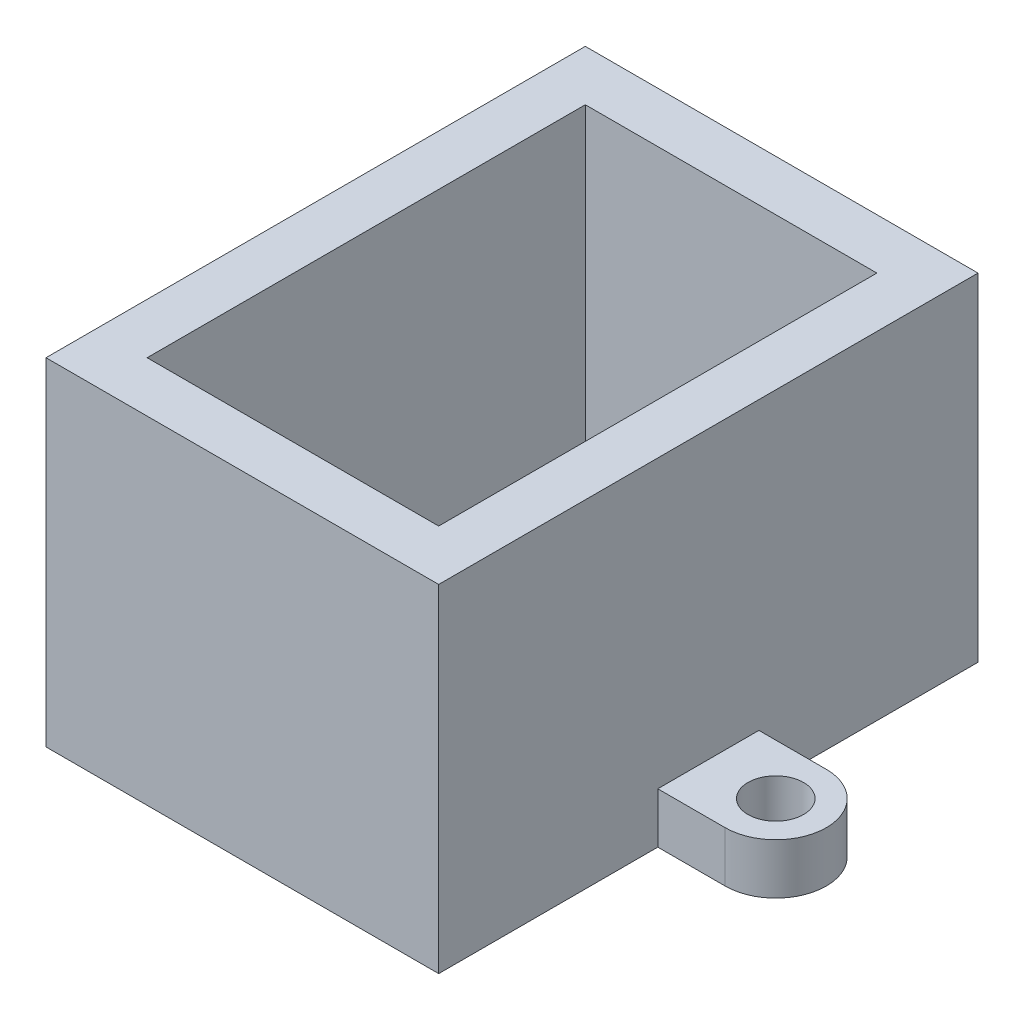
ISO-10303-21;
HEADER;
FILE_DESCRIPTION(('STEP AP214'),'2;1');
FILE_NAME('part.step','',(''),(''),'','','');
FILE_SCHEMA(('AUTOMOTIVE_DESIGN { 1 0 10303 214 1 1 1 1 }'));
ENDSEC;
DATA;
#1=APPLICATION_CONTEXT('core data for automotive mechanical design processes');
#2=APPLICATION_PROTOCOL_DEFINITION('international standard','automotive_design',2000,#1);
#3=PRODUCT_CONTEXT('',#1,'mechanical');
#4=PRODUCT('Part','Part','',(#3));
#5=PRODUCT_RELATED_PRODUCT_CATEGORY('part','',(#4));
#6=PRODUCT_DEFINITION_FORMATION('','',#4);
#7=PRODUCT_DEFINITION_CONTEXT('part definition',#1,'design');
#8=PRODUCT_DEFINITION('design','',#6,#7);
#9=PRODUCT_DEFINITION_SHAPE('','',#8);
#10=(LENGTH_UNIT() NAMED_UNIT(*) SI_UNIT(.MILLI.,.METRE.));
#11=(NAMED_UNIT(*) PLANE_ANGLE_UNIT() SI_UNIT($,.RADIAN.));
#12=(NAMED_UNIT(*) SI_UNIT($,.STERADIAN.) SOLID_ANGLE_UNIT());
#13=UNCERTAINTY_MEASURE_WITH_UNIT(LENGTH_MEASURE(1.E-05),#10,'distance_accuracy_value','');
#14=(GEOMETRIC_REPRESENTATION_CONTEXT(3) GLOBAL_UNCERTAINTY_ASSIGNED_CONTEXT((#13)) GLOBAL_UNIT_ASSIGNED_CONTEXT((#10,
#11,#12)) REPRESENTATION_CONTEXT('',''));
#15=CARTESIAN_POINT('',(0.,0.,0.));
#16=DIRECTION('',(0.,0.,1.));
#17=DIRECTION('',(1.,0.,0.));
#18=AXIS2_PLACEMENT_3D('',#15,#16,#17);
#19=CARTESIAN_POINT('',(11.65,20.,-16.));
#20=DIRECTION('',(-1.,0.,0.));
#21=DIRECTION('',(0.,0.,1.));
#22=AXIS2_PLACEMENT_3D('',#19,#20,#21);
#23=PLANE('',#22);
#24=DIRECTION('',(0.,-1.,0.));
#25=VECTOR('',#24,1.);
#26=CARTESIAN_POINT('',(11.65,3.,3.));
#27=LINE('',#26,#25);
#28=CARTESIAN_POINT('',(11.65,3.,3.));
#29=VERTEX_POINT('',#28);
#30=CARTESIAN_POINT('',(11.65,0.,3.));
#31=VERTEX_POINT('',#30);
#32=EDGE_CURVE('E153',#29,#31,#27,.T.);
#33=ORIENTED_EDGE('',*,*,#32,.F.);
#34=DIRECTION('',(0.,0.,1.));
#35=VECTOR('',#34,1.);
#36=CARTESIAN_POINT('',(11.65,3.,-3.));
#37=LINE('',#36,#35);
#38=CARTESIAN_POINT('',(11.65,3.,-3.));
#39=VERTEX_POINT('',#38);
#40=EDGE_CURVE('E160',#39,#29,#37,.T.);
#41=ORIENTED_EDGE('',*,*,#40,.F.);
#42=DIRECTION('',(0.,-1.,0.));
#43=VECTOR('',#42,1.);
#44=CARTESIAN_POINT('',(11.65,3.,-3.));
#45=LINE('',#44,#43);
#46=CARTESIAN_POINT('',(11.65,0.,-3.));
#47=VERTEX_POINT('',#46);
#48=EDGE_CURVE('E325',#39,#47,#45,.T.);
#49=ORIENTED_EDGE('',*,*,#48,.T.);
#50=DIRECTION('',(0.,0.,-1.));
#51=VECTOR('',#50,1.);
#52=CARTESIAN_POINT('',(11.65,0.,-16.));
#53=LINE('',#52,#51);
#54=CARTESIAN_POINT('',(11.65,0.,-16.));
#55=VERTEX_POINT('',#54);
#56=EDGE_CURVE('E238',#47,#55,#53,.T.);
#57=ORIENTED_EDGE('',*,*,#56,.T.);
#58=DIRECTION('',(0.,-1.,0.));
#59=VECTOR('',#58,1.);
#60=CARTESIAN_POINT('',(11.65,20.,-16.));
#61=LINE('',#60,#59);
#62=CARTESIAN_POINT('',(11.65,20.,-16.));
#63=VERTEX_POINT('',#62);
#64=EDGE_CURVE('E11',#63,#55,#61,.T.);
#65=ORIENTED_EDGE('',*,*,#64,.F.);
#66=DIRECTION('',(0.,0.,-1.));
#67=VECTOR('',#66,1.);
#68=CARTESIAN_POINT('',(11.65,20.,-16.));
#69=LINE('',#68,#67);
#70=CARTESIAN_POINT('',(11.65,20.,16.));
#71=VERTEX_POINT('',#70);
#72=EDGE_CURVE('E239',#71,#63,#69,.T.);
#73=ORIENTED_EDGE('',*,*,#72,.F.);
#74=DIRECTION('',(0.,-1.,0.));
#75=VECTOR('',#74,1.);
#76=CARTESIAN_POINT('',(11.65,20.,16.));
#77=LINE('',#76,#75);
#78=CARTESIAN_POINT('',(11.65,0.,16.));
#79=VERTEX_POINT('',#78);
#80=EDGE_CURVE('E249',#71,#79,#77,.T.);
#81=ORIENTED_EDGE('',*,*,#80,.T.);
#82=EDGE_CURVE('E171',#79,#31,#53,.T.);
#83=ORIENTED_EDGE('',*,*,#82,.T.);
#84=EDGE_LOOP('',(#33,#41,#49,#57,#65,#73,#81,#83));
#85=FACE_BOUND('',#84,.T.);
#86=ADVANCED_FACE('F33',(#85),#23,.F.);
#87=CARTESIAN_POINT('',(-11.65,20.,-16.));
#88=DIRECTION('',(1.,0.,0.));
#89=DIRECTION('',(0.,0.,-1.));
#90=AXIS2_PLACEMENT_3D('',#87,#88,#89);
#91=PLANE('',#90);
#92=DIRECTION('',(0.,-1.,0.));
#93=VECTOR('',#92,1.);
#94=CARTESIAN_POINT('',(-11.65,3.,-3.));
#95=LINE('',#94,#93);
#96=CARTESIAN_POINT('',(-11.65,3.,-3.));
#97=VERTEX_POINT('',#96);
#98=CARTESIAN_POINT('',(-11.65,0.,-3.));
#99=VERTEX_POINT('',#98);
#100=EDGE_CURVE('E204',#97,#99,#95,.T.);
#101=ORIENTED_EDGE('',*,*,#100,.F.);
#102=DIRECTION('',(0.,0.,-1.));
#103=VECTOR('',#102,1.);
#104=CARTESIAN_POINT('',(-11.65,3.,-3.));
#105=LINE('',#104,#103);
#106=CARTESIAN_POINT('',(-11.65,3.,3.));
#107=VERTEX_POINT('',#106);
#108=EDGE_CURVE('E184',#107,#97,#105,.T.);
#109=ORIENTED_EDGE('',*,*,#108,.F.);
#110=DIRECTION('',(0.,-1.,0.));
#111=VECTOR('',#110,1.);
#112=CARTESIAN_POINT('',(-11.65,3.,3.));
#113=LINE('',#112,#111);
#114=CARTESIAN_POINT('',(-11.65,0.,3.));
#115=VERTEX_POINT('',#114);
#116=EDGE_CURVE('E193',#107,#115,#113,.T.);
#117=ORIENTED_EDGE('',*,*,#116,.T.);
#118=DIRECTION('',(0.,0.,1.));
#119=VECTOR('',#118,1.);
#120=CARTESIAN_POINT('',(-11.65,0.,-16.));
#121=LINE('',#120,#119);
#122=CARTESIAN_POINT('',(-11.65,0.,16.));
#123=VERTEX_POINT('',#122);
#124=EDGE_CURVE('E253',#115,#123,#121,.T.);
#125=ORIENTED_EDGE('',*,*,#124,.T.);
#126=DIRECTION('',(0.,-1.,0.));
#127=VECTOR('',#126,1.);
#128=CARTESIAN_POINT('',(-11.65,20.,16.));
#129=LINE('',#128,#127);
#130=CARTESIAN_POINT('',(-11.65,20.,16.));
#131=VERTEX_POINT('',#130);
#132=EDGE_CURVE('E259',#131,#123,#129,.T.);
#133=ORIENTED_EDGE('',*,*,#132,.F.);
#134=DIRECTION('',(0.,0.,1.));
#135=VECTOR('',#134,1.);
#136=CARTESIAN_POINT('',(-11.65,20.,-16.));
#137=LINE('',#136,#135);
#138=CARTESIAN_POINT('',(-11.65,20.,-16.));
#139=VERTEX_POINT('',#138);
#140=EDGE_CURVE('E245',#139,#131,#137,.T.);
#141=ORIENTED_EDGE('',*,*,#140,.F.);
#142=DIRECTION('',(0.,-1.,0.));
#143=VECTOR('',#142,1.);
#144=CARTESIAN_POINT('',(-11.65,20.,-16.));
#145=LINE('',#144,#143);
#146=CARTESIAN_POINT('',(-11.65,0.,-16.));
#147=VERTEX_POINT('',#146);
#148=EDGE_CURVE('E40',#139,#147,#145,.T.);
#149=ORIENTED_EDGE('',*,*,#148,.T.);
#150=EDGE_CURVE('E254',#147,#99,#121,.T.);
#151=ORIENTED_EDGE('',*,*,#150,.T.);
#152=EDGE_LOOP('',(#101,#109,#117,#125,#133,#141,#149,#151));
#153=FACE_BOUND('',#152,.T.);
#154=ADVANCED_FACE('F267',(#153),#91,.F.);
#155=CARTESIAN_POINT('',(0.,20.,0.));
#156=DIRECTION('',(0.,1.,0.));
#157=DIRECTION('',(0.,0.,1.));
#158=AXIS2_PLACEMENT_3D('',#155,#156,#157);
#159=PLANE('',#158);
#160=ORIENTED_EDGE('',*,*,#72,.T.);
#161=DIRECTION('',(-1.,0.,0.));
#162=VECTOR('',#161,1.);
#163=CARTESIAN_POINT('',(-11.65,20.,-16.));
#164=LINE('',#163,#162);
#165=EDGE_CURVE('E242',#63,#139,#164,.T.);
#166=ORIENTED_EDGE('',*,*,#165,.T.);
#167=ORIENTED_EDGE('',*,*,#140,.T.);
#168=DIRECTION('',(1.,0.,0.));
#169=VECTOR('',#168,1.);
#170=CARTESIAN_POINT('',(-11.65,20.,16.));
#171=LINE('',#170,#169);
#172=EDGE_CURVE('E247',#131,#71,#171,.T.);
#173=ORIENTED_EDGE('',*,*,#172,.T.);
#174=EDGE_LOOP('',(#160,#166,#167,#173));
#175=FACE_BOUND('',#174,.T.);
#176=DIRECTION('',(-1.,0.,0.));
#177=VECTOR('',#176,1.);
#178=CARTESIAN_POINT('',(-8.65,20.,-13.));
#179=LINE('',#178,#177);
#180=CARTESIAN_POINT('',(8.65,20.,-13.));
#181=VERTEX_POINT('',#180);
#182=CARTESIAN_POINT('',(-8.65,20.,-13.));
#183=VERTEX_POINT('',#182);
#184=EDGE_CURVE('E210',#181,#183,#179,.T.);
#185=ORIENTED_EDGE('',*,*,#184,.F.);
#186=DIRECTION('',(0.,0.,-1.));
#187=VECTOR('',#186,1.);
#188=CARTESIAN_POINT('',(8.65,20.,-13.));
#189=LINE('',#188,#187);
#190=CARTESIAN_POINT('',(8.65,20.,13.));
#191=VERTEX_POINT('',#190);
#192=EDGE_CURVE('E208',#191,#181,#189,.T.);
#193=ORIENTED_EDGE('',*,*,#192,.F.);
#194=DIRECTION('',(1.,0.,0.));
#195=VECTOR('',#194,1.);
#196=CARTESIAN_POINT('',(-8.65,20.,13.));
#197=LINE('',#196,#195);
#198=CARTESIAN_POINT('',(-8.65,20.,13.));
#199=VERTEX_POINT('',#198);
#200=EDGE_CURVE('E216',#199,#191,#197,.T.);
#201=ORIENTED_EDGE('',*,*,#200,.F.);
#202=DIRECTION('',(0.,0.,1.));
#203=VECTOR('',#202,1.);
#204=CARTESIAN_POINT('',(-8.65,20.,-13.));
#205=LINE('',#204,#203);
#206=EDGE_CURVE('E213',#183,#199,#205,.T.);
#207=ORIENTED_EDGE('',*,*,#206,.F.);
#208=EDGE_LOOP('',(#185,#193,#201,#207));
#209=FACE_BOUND('',#208,.T.);
#210=ADVANCED_FACE('F305',(#175,#209),#159,.T.);
#211=CARTESIAN_POINT('',(0.,0.,0.));
#212=DIRECTION('',(0.,1.,0.));
#213=DIRECTION('',(0.,0.,1.));
#214=AXIS2_PLACEMENT_3D('',#211,#212,#213);
#215=PLANE('',#214);
#216=ORIENTED_EDGE('',*,*,#82,.F.);
#217=DIRECTION('',(1.,0.,0.));
#218=VECTOR('',#217,1.);
#219=CARTESIAN_POINT('',(-11.65,0.,16.));
#220=LINE('',#219,#218);
#221=EDGE_CURVE('E243',#123,#79,#220,.T.);
#222=ORIENTED_EDGE('',*,*,#221,.F.);
#223=ORIENTED_EDGE('',*,*,#124,.F.);
#224=DIRECTION('',(1.,0.,0.));
#225=VECTOR('',#224,1.);
#226=CARTESIAN_POINT('',(-11.65,0.,3.));
#227=LINE('',#226,#225);
#228=CARTESIAN_POINT('',(-15.65,0.,3.));
#229=VERTEX_POINT('',#228);
#230=EDGE_CURVE('E55',#229,#115,#227,.T.);
#231=ORIENTED_EDGE('',*,*,#230,.F.);
#232=CARTESIAN_POINT('',(-15.65,0.,0.));
#233=DIRECTION('',(0.,1.,0.));
#234=DIRECTION('',(0.,0.,-1.));
#235=AXIS2_PLACEMENT_3D('',#232,#233,#234);
#236=CIRCLE('',#235,3.);
#237=CARTESIAN_POINT('',(-15.65,0.,-3.));
#238=VERTEX_POINT('',#237);
#239=EDGE_CURVE('E195',#238,#229,#236,.T.);
#240=ORIENTED_EDGE('',*,*,#239,.F.);
#241=DIRECTION('',(-1.,0.,0.));
#242=VECTOR('',#241,1.);
#243=CARTESIAN_POINT('',(-15.65,0.,-3.));
#244=LINE('',#243,#242);
#245=EDGE_CURVE('E182',#99,#238,#244,.T.);
#246=ORIENTED_EDGE('',*,*,#245,.F.);
#247=ORIENTED_EDGE('',*,*,#150,.F.);
#248=DIRECTION('',(-1.,0.,0.));
#249=VECTOR('',#248,1.);
#250=CARTESIAN_POINT('',(-11.65,0.,-16.));
#251=LINE('',#250,#249);
#252=EDGE_CURVE('E251',#55,#147,#251,.T.);
#253=ORIENTED_EDGE('',*,*,#252,.F.);
#254=ORIENTED_EDGE('',*,*,#56,.F.);
#255=DIRECTION('',(-1.,0.,0.));
#256=VECTOR('',#255,1.);
#257=CARTESIAN_POINT('',(11.65,0.,-3.));
#258=LINE('',#257,#256);
#259=CARTESIAN_POINT('',(15.65,0.,-3.));
#260=VERTEX_POINT('',#259);
#261=EDGE_CURVE('E47',#260,#47,#258,.T.);
#262=ORIENTED_EDGE('',*,*,#261,.F.);
#263=CARTESIAN_POINT('',(15.65,0.,0.));
#264=DIRECTION('',(0.,1.,0.));
#265=DIRECTION('',(0.,0.,-1.));
#266=AXIS2_PLACEMENT_3D('',#263,#264,#265);
#267=CIRCLE('',#266,3.);
#268=CARTESIAN_POINT('',(15.65,0.,3.));
#269=VERTEX_POINT('',#268);
#270=EDGE_CURVE('E327',#269,#260,#267,.T.);
#271=ORIENTED_EDGE('',*,*,#270,.F.);
#272=DIRECTION('',(1.,0.,0.));
#273=VECTOR('',#272,1.);
#274=CARTESIAN_POINT('',(15.65,0.,3.));
#275=LINE('',#274,#273);
#276=EDGE_CURVE('E329',#31,#269,#275,.T.);
#277=ORIENTED_EDGE('',*,*,#276,.F.);
#278=EDGE_LOOP('',(#216,#222,#223,#231,#240,#246,#247,#253,#254,#262,#271,#277));
#279=FACE_BOUND('',#278,.T.);
#280=DIRECTION('',(0.,0.,-1.));
#281=VECTOR('',#280,1.);
#282=CARTESIAN_POINT('',(8.65,0.,-13.));
#283=LINE('',#282,#281);
#284=CARTESIAN_POINT('',(8.65,0.,13.));
#285=VERTEX_POINT('',#284);
#286=CARTESIAN_POINT('',(8.65,0.,-13.));
#287=VERTEX_POINT('',#286);
#288=EDGE_CURVE('E207',#285,#287,#283,.T.);
#289=ORIENTED_EDGE('',*,*,#288,.T.);
#290=DIRECTION('',(-1.,0.,0.));
#291=VECTOR('',#290,1.);
#292=CARTESIAN_POINT('',(-8.65,0.,-13.));
#293=LINE('',#292,#291);
#294=CARTESIAN_POINT('',(-8.65,0.,-13.));
#295=VERTEX_POINT('',#294);
#296=EDGE_CURVE('E221',#287,#295,#293,.T.);
#297=ORIENTED_EDGE('',*,*,#296,.T.);
#298=DIRECTION('',(0.,0.,1.));
#299=VECTOR('',#298,1.);
#300=CARTESIAN_POINT('',(-8.65,0.,-13.));
#301=LINE('',#300,#299);
#302=CARTESIAN_POINT('',(-8.65,0.,13.));
#303=VERTEX_POINT('',#302);
#304=EDGE_CURVE('E224',#295,#303,#301,.T.);
#305=ORIENTED_EDGE('',*,*,#304,.T.);
#306=DIRECTION('',(1.,0.,0.));
#307=VECTOR('',#306,1.);
#308=CARTESIAN_POINT('',(-8.65,0.,13.));
#309=LINE('',#308,#307);
#310=EDGE_CURVE('E211',#303,#285,#309,.T.);
#311=ORIENTED_EDGE('',*,*,#310,.T.);
#312=EDGE_LOOP('',(#289,#297,#305,#311));
#313=FACE_BOUND('',#312,.T.);
#314=CARTESIAN_POINT('',(-15.65,0.,0.));
#315=DIRECTION('',(0.,1.,0.));
#316=DIRECTION('',(0.,0.,1.));
#317=AXIS2_PLACEMENT_3D('',#314,#315,#316);
#318=CIRCLE('',#317,1.65);
#319=CARTESIAN_POINT('',(-15.65,0.,1.65));
#320=VERTEX_POINT('',#319);
#321=EDGE_CURVE('E172',#320,#320,#318,.T.);
#322=ORIENTED_EDGE('',*,*,#321,.T.);
#323=EDGE_LOOP('',(#322));
#324=FACE_BOUND('',#323,.T.);
#325=CARTESIAN_POINT('',(15.65,0.,0.));
#326=DIRECTION('',(0.,1.,0.));
#327=DIRECTION('',(0.,0.,1.));
#328=AXIS2_PLACEMENT_3D('',#325,#326,#327);
#329=CIRCLE('',#328,1.65);
#330=CARTESIAN_POINT('',(15.65,0.,1.65));
#331=VERTEX_POINT('',#330);
#332=EDGE_CURVE('E341',#331,#331,#329,.T.);
#333=ORIENTED_EDGE('',*,*,#332,.T.);
#334=EDGE_LOOP('',(#333));
#335=FACE_BOUND('',#334,.T.);
#336=ADVANCED_FACE('F272',(#279,#313,#324,#335),#215,.F.);
#337=CARTESIAN_POINT('',(-11.65,20.,-16.));
#338=DIRECTION('',(0.,0.,1.));
#339=DIRECTION('',(1.,0.,0.));
#340=AXIS2_PLACEMENT_3D('',#337,#338,#339);
#341=PLANE('',#340);
#342=ORIENTED_EDGE('',*,*,#252,.T.);
#343=ORIENTED_EDGE('',*,*,#148,.F.);
#344=ORIENTED_EDGE('',*,*,#165,.F.);
#345=ORIENTED_EDGE('',*,*,#64,.T.);
#346=EDGE_LOOP('',(#342,#343,#344,#345));
#347=FACE_BOUND('',#346,.T.);
#348=ADVANCED_FACE('F315',(#347),#341,.F.);
#349=CARTESIAN_POINT('',(-11.65,20.,16.));
#350=DIRECTION('',(0.,0.,-1.));
#351=DIRECTION('',(-1.,0.,0.));
#352=AXIS2_PLACEMENT_3D('',#349,#350,#351);
#353=PLANE('',#352);
#354=ORIENTED_EDGE('',*,*,#221,.T.);
#355=ORIENTED_EDGE('',*,*,#80,.F.);
#356=ORIENTED_EDGE('',*,*,#172,.F.);
#357=ORIENTED_EDGE('',*,*,#132,.T.);
#358=EDGE_LOOP('',(#354,#355,#356,#357));
#359=FACE_BOUND('',#358,.T.);
#360=ADVANCED_FACE('F313',(#359),#353,.F.);
#361=CARTESIAN_POINT('',(8.65,20.,-13.));
#362=DIRECTION('',(-1.,0.,0.));
#363=DIRECTION('',(0.,0.,1.));
#364=AXIS2_PLACEMENT_3D('',#361,#362,#363);
#365=PLANE('',#364);
#366=ORIENTED_EDGE('',*,*,#288,.F.);
#367=DIRECTION('',(0.,-1.,0.));
#368=VECTOR('',#367,1.);
#369=CARTESIAN_POINT('',(8.65,20.,13.));
#370=LINE('',#369,#368);
#371=EDGE_CURVE('E218',#191,#285,#370,.T.);
#372=ORIENTED_EDGE('',*,*,#371,.F.);
#373=ORIENTED_EDGE('',*,*,#192,.T.);
#374=DIRECTION('',(0.,-1.,0.));
#375=VECTOR('',#374,1.);
#376=CARTESIAN_POINT('',(8.65,20.,-13.));
#377=LINE('',#376,#375);
#378=EDGE_CURVE('E235',#181,#287,#377,.T.);
#379=ORIENTED_EDGE('',*,*,#378,.T.);
#380=EDGE_LOOP('',(#366,#372,#373,#379));
#381=FACE_BOUND('',#380,.T.);
#382=ADVANCED_FACE('F321',(#381),#365,.T.);
#383=CARTESIAN_POINT('',(-8.65,20.,-13.));
#384=DIRECTION('',(0.,0.,1.));
#385=DIRECTION('',(1.,0.,0.));
#386=AXIS2_PLACEMENT_3D('',#383,#384,#385);
#387=PLANE('',#386);
#388=ORIENTED_EDGE('',*,*,#296,.F.);
#389=ORIENTED_EDGE('',*,*,#378,.F.);
#390=ORIENTED_EDGE('',*,*,#184,.T.);
#391=DIRECTION('',(0.,-1.,0.));
#392=VECTOR('',#391,1.);
#393=CARTESIAN_POINT('',(-8.65,20.,-13.));
#394=LINE('',#393,#392);
#395=EDGE_CURVE('E233',#183,#295,#394,.T.);
#396=ORIENTED_EDGE('',*,*,#395,.T.);
#397=EDGE_LOOP('',(#388,#389,#390,#396));
#398=FACE_BOUND('',#397,.T.);
#399=ADVANCED_FACE('F376',(#398),#387,.T.);
#400=CARTESIAN_POINT('',(-8.65,20.,-13.));
#401=DIRECTION('',(1.,0.,0.));
#402=DIRECTION('',(0.,0.,-1.));
#403=AXIS2_PLACEMENT_3D('',#400,#401,#402);
#404=PLANE('',#403);
#405=ORIENTED_EDGE('',*,*,#304,.F.);
#406=ORIENTED_EDGE('',*,*,#395,.F.);
#407=ORIENTED_EDGE('',*,*,#206,.T.);
#408=DIRECTION('',(0.,-1.,0.));
#409=VECTOR('',#408,1.);
#410=CARTESIAN_POINT('',(-8.65,20.,13.));
#411=LINE('',#410,#409);
#412=EDGE_CURVE('E231',#199,#303,#411,.T.);
#413=ORIENTED_EDGE('',*,*,#412,.T.);
#414=EDGE_LOOP('',(#405,#406,#407,#413));
#415=FACE_BOUND('',#414,.T.);
#416=ADVANCED_FACE('F370',(#415),#404,.T.);
#417=CARTESIAN_POINT('',(-8.65,20.,13.));
#418=DIRECTION('',(0.,0.,-1.));
#419=DIRECTION('',(-1.,0.,0.));
#420=AXIS2_PLACEMENT_3D('',#417,#418,#419);
#421=PLANE('',#420);
#422=ORIENTED_EDGE('',*,*,#310,.F.);
#423=ORIENTED_EDGE('',*,*,#412,.F.);
#424=ORIENTED_EDGE('',*,*,#200,.T.);
#425=ORIENTED_EDGE('',*,*,#371,.T.);
#426=EDGE_LOOP('',(#422,#423,#424,#425));
#427=FACE_BOUND('',#426,.T.);
#428=ADVANCED_FACE('F364',(#427),#421,.T.);
#429=CARTESIAN_POINT('',(-15.65,3.,0.));
#430=DIRECTION('',(0.,-1.,0.));
#431=DIRECTION('',(0.,0.,-1.));
#432=AXIS2_PLACEMENT_3D('',#429,#430,#431);
#433=PLANE('',#432);
#434=ORIENTED_EDGE('',*,*,#108,.T.);
#435=DIRECTION('',(-1.,0.,0.));
#436=VECTOR('',#435,1.);
#437=CARTESIAN_POINT('',(-15.65,3.,-3.));
#438=LINE('',#437,#436);
#439=CARTESIAN_POINT('',(-15.65,3.,-3.));
#440=VERTEX_POINT('',#439);
#441=EDGE_CURVE('E187',#97,#440,#438,.T.);
#442=ORIENTED_EDGE('',*,*,#441,.T.);
#443=CARTESIAN_POINT('',(-15.65,3.,0.));
#444=DIRECTION('',(0.,1.,0.));
#445=DIRECTION('',(0.,0.,-1.));
#446=AXIS2_PLACEMENT_3D('',#443,#444,#445);
#447=CIRCLE('',#446,3.);
#448=CARTESIAN_POINT('',(-15.65,3.,3.));
#449=VERTEX_POINT('',#448);
#450=EDGE_CURVE('E189',#440,#449,#447,.T.);
#451=ORIENTED_EDGE('',*,*,#450,.T.);
#452=DIRECTION('',(1.,0.,0.));
#453=VECTOR('',#452,1.);
#454=CARTESIAN_POINT('',(-11.65,3.,3.));
#455=LINE('',#454,#453);
#456=EDGE_CURVE('E191',#449,#107,#455,.T.);
#457=ORIENTED_EDGE('',*,*,#456,.T.);
#458=EDGE_LOOP('',(#434,#442,#451,#457));
#459=FACE_BOUND('',#458,.T.);
#460=CARTESIAN_POINT('',(-15.65,3.,0.));
#461=DIRECTION('',(0.,1.,0.));
#462=DIRECTION('',(0.,0.,1.));
#463=AXIS2_PLACEMENT_3D('',#460,#461,#462);
#464=CIRCLE('',#463,1.65);
#465=CARTESIAN_POINT('',(-15.65,3.,1.65));
#466=VERTEX_POINT('',#465);
#467=EDGE_CURVE('E175',#466,#466,#464,.T.);
#468=ORIENTED_EDGE('',*,*,#467,.F.);
#469=EDGE_LOOP('',(#468));
#470=FACE_BOUND('',#469,.T.);
#471=ADVANCED_FACE('F282',(#459,#470),#433,.F.);
#472=CARTESIAN_POINT('',(-15.65,3.,-3.));
#473=DIRECTION('',(0.,0.,1.));
#474=DIRECTION('',(1.,0.,0.));
#475=AXIS2_PLACEMENT_3D('',#472,#473,#474);
#476=PLANE('',#475);
#477=ORIENTED_EDGE('',*,*,#245,.T.);
#478=DIRECTION('',(0.,-1.,0.));
#479=VECTOR('',#478,1.);
#480=CARTESIAN_POINT('',(-15.65,3.,-3.));
#481=LINE('',#480,#479);
#482=EDGE_CURVE('E201',#440,#238,#481,.T.);
#483=ORIENTED_EDGE('',*,*,#482,.F.);
#484=ORIENTED_EDGE('',*,*,#441,.F.);
#485=ORIENTED_EDGE('',*,*,#100,.T.);
#486=EDGE_LOOP('',(#477,#483,#484,#485));
#487=FACE_BOUND('',#486,.T.);
#488=ADVANCED_FACE('F278',(#487),#476,.F.);
#489=CARTESIAN_POINT('',(-15.65,3.,0.));
#490=DIRECTION('',(0.,-1.,0.));
#491=DIRECTION('',(0.,0.,-1.));
#492=AXIS2_PLACEMENT_3D('',#489,#490,#491);
#493=CYLINDRICAL_SURFACE('',#492,3.);
#494=ORIENTED_EDGE('',*,*,#239,.T.);
#495=DIRECTION('',(0.,-1.,0.));
#496=VECTOR('',#495,1.);
#497=CARTESIAN_POINT('',(-15.65,3.,3.));
#498=LINE('',#497,#496);
#499=EDGE_CURVE('E199',#449,#229,#498,.T.);
#500=ORIENTED_EDGE('',*,*,#499,.F.);
#501=ORIENTED_EDGE('',*,*,#450,.F.);
#502=ORIENTED_EDGE('',*,*,#482,.T.);
#503=EDGE_LOOP('',(#494,#500,#501,#502));
#504=FACE_BOUND('',#503,.T.);
#505=ADVANCED_FACE('F290',(#504),#493,.T.);
#506=CARTESIAN_POINT('',(-11.65,3.,3.));
#507=DIRECTION('',(0.,0.,-1.));
#508=DIRECTION('',(-1.,0.,0.));
#509=AXIS2_PLACEMENT_3D('',#506,#507,#508);
#510=PLANE('',#509);
#511=ORIENTED_EDGE('',*,*,#230,.T.);
#512=ORIENTED_EDGE('',*,*,#116,.F.);
#513=ORIENTED_EDGE('',*,*,#456,.F.);
#514=ORIENTED_EDGE('',*,*,#499,.T.);
#515=EDGE_LOOP('',(#511,#512,#513,#514));
#516=FACE_BOUND('',#515,.T.);
#517=ADVANCED_FACE('F287',(#516),#510,.F.);
#518=CARTESIAN_POINT('',(-15.65,3.,0.));
#519=DIRECTION('',(0.,-1.,0.));
#520=DIRECTION('',(0.,0.,-1.));
#521=AXIS2_PLACEMENT_3D('',#518,#519,#520);
#522=CYLINDRICAL_SURFACE('',#521,1.65);
#523=ORIENTED_EDGE('',*,*,#467,.T.);
#524=EDGE_LOOP('',(#523));
#525=FACE_BOUND('',#524,.T.);
#526=ORIENTED_EDGE('',*,*,#321,.F.);
#527=EDGE_LOOP('',(#526));
#528=FACE_BOUND('',#527,.T.);
#529=ADVANCED_FACE('F289',(#525,#528),#522,.F.);
#530=CARTESIAN_POINT('',(15.65,3.,0.));
#531=DIRECTION('',(0.,-1.,0.));
#532=DIRECTION('',(0.,0.,-1.));
#533=AXIS2_PLACEMENT_3D('',#530,#531,#532);
#534=PLANE('',#533);
#535=ORIENTED_EDGE('',*,*,#40,.T.);
#536=DIRECTION('',(1.,0.,0.));
#537=VECTOR('',#536,1.);
#538=CARTESIAN_POINT('',(15.65,3.,3.));
#539=LINE('',#538,#537);
#540=CARTESIAN_POINT('',(15.65,3.,3.));
#541=VERTEX_POINT('',#540);
#542=EDGE_CURVE('E149',#29,#541,#539,.T.);
#543=ORIENTED_EDGE('',*,*,#542,.T.);
#544=CARTESIAN_POINT('',(15.65,3.,0.));
#545=DIRECTION('',(0.,1.,0.));
#546=DIRECTION('',(0.,0.,-1.));
#547=AXIS2_PLACEMENT_3D('',#544,#545,#546);
#548=CIRCLE('',#547,3.);
#549=CARTESIAN_POINT('',(15.65,3.,-3.));
#550=VERTEX_POINT('',#549);
#551=EDGE_CURVE('E159',#541,#550,#548,.T.);
#552=ORIENTED_EDGE('',*,*,#551,.T.);
#553=DIRECTION('',(-1.,0.,0.));
#554=VECTOR('',#553,1.);
#555=CARTESIAN_POINT('',(11.65,3.,-3.));
#556=LINE('',#555,#554);
#557=EDGE_CURVE('E166',#550,#39,#556,.T.);
#558=ORIENTED_EDGE('',*,*,#557,.T.);
#559=EDGE_LOOP('',(#535,#543,#552,#558));
#560=FACE_BOUND('',#559,.T.);
#561=CARTESIAN_POINT('',(15.65,3.,0.));
#562=DIRECTION('',(0.,1.,0.));
#563=DIRECTION('',(0.,0.,1.));
#564=AXIS2_PLACEMENT_3D('',#561,#562,#563);
#565=CIRCLE('',#564,1.65);
#566=CARTESIAN_POINT('',(15.65,3.,1.65));
#567=VERTEX_POINT('',#566);
#568=EDGE_CURVE('E339',#567,#567,#565,.T.);
#569=ORIENTED_EDGE('',*,*,#568,.F.);
#570=EDGE_LOOP('',(#569));
#571=FACE_BOUND('',#570,.T.);
#572=ADVANCED_FACE('F163',(#560,#571),#534,.F.);
#573=CARTESIAN_POINT('',(15.65,3.,3.));
#574=DIRECTION('',(0.,0.,-1.));
#575=DIRECTION('',(-1.,0.,0.));
#576=AXIS2_PLACEMENT_3D('',#573,#574,#575);
#577=PLANE('',#576);
#578=ORIENTED_EDGE('',*,*,#276,.T.);
#579=DIRECTION('',(0.,-1.,0.));
#580=VECTOR('',#579,1.);
#581=CARTESIAN_POINT('',(15.65,3.,3.));
#582=LINE('',#581,#580);
#583=EDGE_CURVE('E156',#541,#269,#582,.T.);
#584=ORIENTED_EDGE('',*,*,#583,.F.);
#585=ORIENTED_EDGE('',*,*,#542,.F.);
#586=ORIENTED_EDGE('',*,*,#32,.T.);
#587=EDGE_LOOP('',(#578,#584,#585,#586));
#588=FACE_BOUND('',#587,.T.);
#589=ADVANCED_FACE('F151',(#588),#577,.F.);
#590=CARTESIAN_POINT('',(15.65,3.,0.));
#591=DIRECTION('',(0.,-1.,0.));
#592=DIRECTION('',(0.,0.,-1.));
#593=AXIS2_PLACEMENT_3D('',#590,#591,#592);
#594=CYLINDRICAL_SURFACE('',#593,3.);
#595=ORIENTED_EDGE('',*,*,#270,.T.);
#596=DIRECTION('',(0.,-1.,0.));
#597=VECTOR('',#596,1.);
#598=CARTESIAN_POINT('',(15.65,3.,-3.));
#599=LINE('',#598,#597);
#600=EDGE_CURVE('E177',#550,#260,#599,.T.);
#601=ORIENTED_EDGE('',*,*,#600,.F.);
#602=ORIENTED_EDGE('',*,*,#551,.F.);
#603=ORIENTED_EDGE('',*,*,#583,.T.);
#604=EDGE_LOOP('',(#595,#601,#602,#603));
#605=FACE_BOUND('',#604,.T.);
#606=ADVANCED_FACE('F336',(#605),#594,.T.);
#607=CARTESIAN_POINT('',(11.65,3.,-3.));
#608=DIRECTION('',(0.,0.,1.));
#609=DIRECTION('',(1.,0.,0.));
#610=AXIS2_PLACEMENT_3D('',#607,#608,#609);
#611=PLANE('',#610);
#612=ORIENTED_EDGE('',*,*,#261,.T.);
#613=ORIENTED_EDGE('',*,*,#48,.F.);
#614=ORIENTED_EDGE('',*,*,#557,.F.);
#615=ORIENTED_EDGE('',*,*,#600,.T.);
#616=EDGE_LOOP('',(#612,#613,#614,#615));
#617=FACE_BOUND('',#616,.T.);
#618=ADVANCED_FACE('F334',(#617),#611,.F.);
#619=CARTESIAN_POINT('',(15.65,3.,0.));
#620=DIRECTION('',(0.,-1.,0.));
#621=DIRECTION('',(0.,0.,-1.));
#622=AXIS2_PLACEMENT_3D('',#619,#620,#621);
#623=CYLINDRICAL_SURFACE('',#622,1.65);
#624=ORIENTED_EDGE('',*,*,#568,.T.);
#625=EDGE_LOOP('',(#624));
#626=FACE_BOUND('',#625,.T.);
#627=ORIENTED_EDGE('',*,*,#332,.F.);
#628=EDGE_LOOP('',(#627));
#629=FACE_BOUND('',#628,.T.);
#630=ADVANCED_FACE('F350',(#626,#629),#623,.F.);
#631=CLOSED_SHELL('',(#86,#154,#210,#336,#348,#360,#382,#399,#416,#428,#471,#488,#505,#517,#529,
#572,#589,#606,#618,#630));
#632=MANIFOLD_SOLID_BREP('B2',#631);
#633=ADVANCED_BREP_SHAPE_REPRESENTATION('',(#18,#632),#14);
#634=SHAPE_DEFINITION_REPRESENTATION(#9,#633);
ENDSEC;
END-ISO-10303-21;
